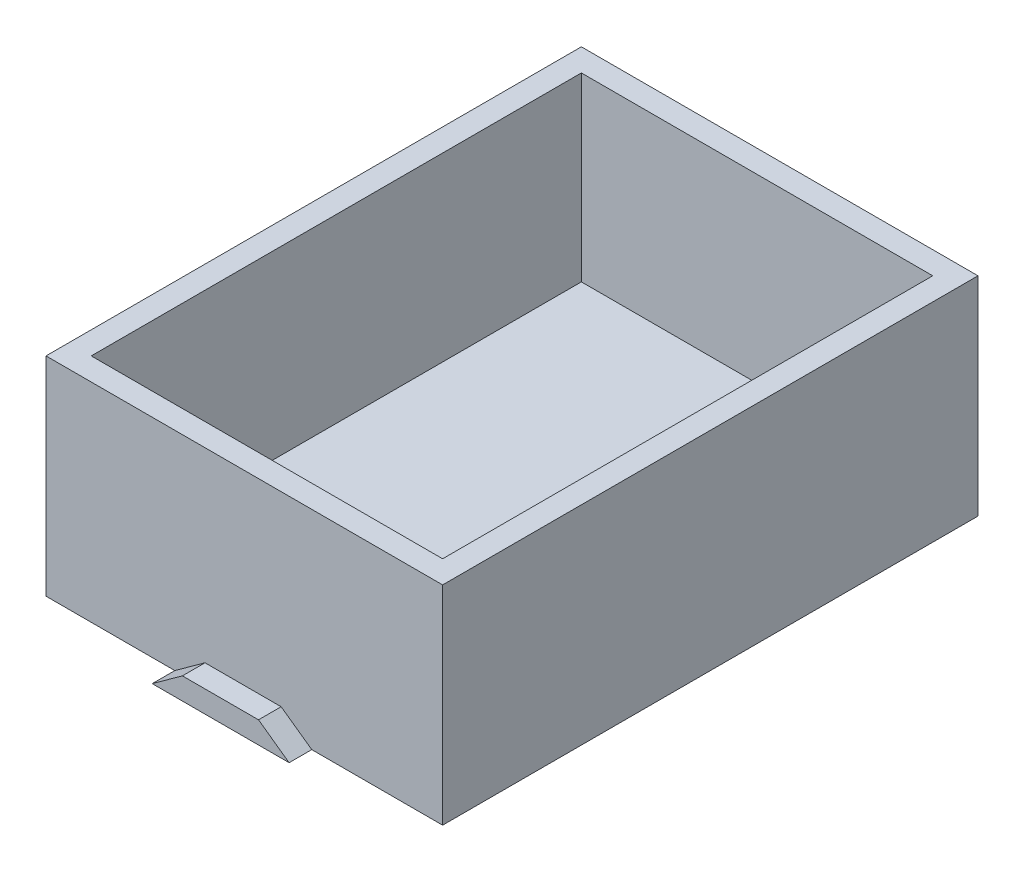
ISO-10303-21;
HEADER;
FILE_DESCRIPTION(('STEP AP214'),'2;1');
FILE_NAME('part.step','',(''),(''),'','','');
FILE_SCHEMA(('AUTOMOTIVE_DESIGN { 1 0 10303 214 1 1 1 1 }'));
ENDSEC;
DATA;
#1=APPLICATION_CONTEXT('core data for automotive mechanical design processes');
#2=APPLICATION_PROTOCOL_DEFINITION('international standard','automotive_design',2000,#1);
#3=PRODUCT_CONTEXT('',#1,'mechanical');
#4=PRODUCT('Part','Part','',(#3));
#5=PRODUCT_RELATED_PRODUCT_CATEGORY('part','',(#4));
#6=PRODUCT_DEFINITION_FORMATION('','',#4);
#7=PRODUCT_DEFINITION_CONTEXT('part definition',#1,'design');
#8=PRODUCT_DEFINITION('design','',#6,#7);
#9=PRODUCT_DEFINITION_SHAPE('','',#8);
#10=(LENGTH_UNIT() NAMED_UNIT(*) SI_UNIT(.MILLI.,.METRE.));
#11=(NAMED_UNIT(*) PLANE_ANGLE_UNIT() SI_UNIT($,.RADIAN.));
#12=(NAMED_UNIT(*) SI_UNIT($,.STERADIAN.) SOLID_ANGLE_UNIT());
#13=UNCERTAINTY_MEASURE_WITH_UNIT(LENGTH_MEASURE(1.E-05),#10,'distance_accuracy_value','');
#14=(GEOMETRIC_REPRESENTATION_CONTEXT(3) GLOBAL_UNCERTAINTY_ASSIGNED_CONTEXT((#13)) GLOBAL_UNIT_ASSIGNED_CONTEXT((#10,
#11,#12)) REPRESENTATION_CONTEXT('',''));
#15=CARTESIAN_POINT('',(0.,0.,0.));
#16=DIRECTION('',(0.,0.,1.));
#17=DIRECTION('',(1.,0.,0.));
#18=AXIS2_PLACEMENT_3D('',#15,#16,#17);
#19=CARTESIAN_POINT('',(0.,0.,0.));
#20=DIRECTION('',(0.,0.,-1.));
#21=DIRECTION('',(-1.,0.,0.));
#22=AXIS2_PLACEMENT_3D('',#19,#20,#21);
#23=PLANE('',#22);
#24=DIRECTION('',(-0.813991379659755,0.580876952408692,0.));
#25=VECTOR('',#24,1.);
#26=CARTESIAN_POINT('',(15.1022059545549,21.1629423578934,0.));
#27=LINE('',#26,#25);
#28=CARTESIAN_POINT('',(44.7581469866952,0.,0.));
#29=VERTEX_POINT('',#28);
#30=CARTESIAN_POINT('',(39.6021416062323,3.6794059087677,0.));
#31=VERTEX_POINT('',#30);
#32=EDGE_CURVE('E149',#29,#31,#27,.T.);
#33=ORIENTED_EDGE('',*,*,#32,.F.);
#34=DIRECTION('',(1.,0.,0.));
#35=VECTOR('',#34,1.);
#36=CARTESIAN_POINT('',(0.,0.,0.));
#37=LINE('',#36,#35);
#38=CARTESIAN_POINT('',(66.802,0.,0.));
#39=VERTEX_POINT('',#38);
#40=EDGE_CURVE('E222',#29,#39,#37,.T.);
#41=ORIENTED_EDGE('',*,*,#40,.T.);
#42=DIRECTION('',(0.,1.,0.));
#43=VECTOR('',#42,1.);
#44=CARTESIAN_POINT('',(66.802,35.052,0.));
#45=LINE('',#44,#43);
#46=CARTESIAN_POINT('',(66.802,35.052,0.));
#47=VERTEX_POINT('',#46);
#48=EDGE_CURVE('E226',#39,#47,#45,.T.);
#49=ORIENTED_EDGE('',*,*,#48,.T.);
#50=DIRECTION('',(-1.,0.,0.));
#51=VECTOR('',#50,1.);
#52=CARTESIAN_POINT('',(0.,35.052,0.));
#53=LINE('',#52,#51);
#54=CARTESIAN_POINT('',(0.,35.052,0.));
#55=VERTEX_POINT('',#54);
#56=EDGE_CURVE('E207',#47,#55,#53,.T.);
#57=ORIENTED_EDGE('',*,*,#56,.T.);
#58=DIRECTION('',(0.,-1.,0.));
#59=VECTOR('',#58,1.);
#60=CARTESIAN_POINT('',(0.,0.,0.));
#61=LINE('',#60,#59);
#62=CARTESIAN_POINT('',(0.,0.,0.));
#63=VERTEX_POINT('',#62);
#64=EDGE_CURVE('E192',#55,#63,#61,.T.);
#65=ORIENTED_EDGE('',*,*,#64,.T.);
#66=CARTESIAN_POINT('',(21.6954742713817,0.,0.));
#67=VERTEX_POINT('',#66);
#68=EDGE_CURVE('E223',#63,#67,#37,.T.);
#69=ORIENTED_EDGE('',*,*,#68,.T.);
#70=DIRECTION('',(-0.810229448212507,-0.586112822969483,0.));
#71=VECTOR('',#70,1.);
#72=CARTESIAN_POINT('',(7.45300811951626,-10.3028741558746,0.));
#73=LINE('',#72,#71);
#74=CARTESIAN_POINT('',(26.7818039034599,3.67940590876769,0.));
#75=VERTEX_POINT('',#74);
#76=EDGE_CURVE('E62',#75,#67,#73,.T.);
#77=ORIENTED_EDGE('',*,*,#76,.F.);
#78=DIRECTION('',(-1.,0.,0.));
#79=VECTOR('',#78,1.);
#80=CARTESIAN_POINT('',(0.,3.67940590876769,0.));
#81=LINE('',#80,#79);
#82=EDGE_CURVE('E57',#31,#75,#81,.T.);
#83=ORIENTED_EDGE('',*,*,#82,.F.);
#84=EDGE_LOOP('',(#33,#41,#49,#57,#65,#69,#77,#83));
#85=FACE_BOUND('',#84,.T.);
#86=ADVANCED_FACE('F39',(#85),#23,.F.);
#87=CARTESIAN_POINT('',(0.,0.,-90.17));
#88=DIRECTION('',(-1.,0.,0.));
#89=DIRECTION('',(0.,0.,1.));
#90=AXIS2_PLACEMENT_3D('',#87,#88,#89);
#91=PLANE('',#90);
#92=ORIENTED_EDGE('',*,*,#64,.F.);
#93=DIRECTION('',(0.,0.,1.));
#94=VECTOR('',#93,1.);
#95=CARTESIAN_POINT('',(0.,35.052,-90.17));
#96=LINE('',#95,#94);
#97=CARTESIAN_POINT('',(0.,35.052,-90.17));
#98=VERTEX_POINT('',#97);
#99=EDGE_CURVE('E11',#98,#55,#96,.T.);
#100=ORIENTED_EDGE('',*,*,#99,.F.);
#101=DIRECTION('',(0.,-1.,0.));
#102=VECTOR('',#101,1.);
#103=CARTESIAN_POINT('',(0.,0.,-90.17));
#104=LINE('',#103,#102);
#105=CARTESIAN_POINT('',(0.,0.,-90.17));
#106=VERTEX_POINT('',#105);
#107=EDGE_CURVE('E202',#98,#106,#104,.T.);
#108=ORIENTED_EDGE('',*,*,#107,.T.);
#109=DIRECTION('',(0.,0.,1.));
#110=VECTOR('',#109,1.);
#111=CARTESIAN_POINT('',(0.,0.,-90.17));
#112=LINE('',#111,#110);
#113=EDGE_CURVE('E43',#106,#63,#112,.T.);
#114=ORIENTED_EDGE('',*,*,#113,.T.);
#115=EDGE_LOOP('',(#92,#100,#108,#114));
#116=FACE_BOUND('',#115,.T.);
#117=ADVANCED_FACE('F41',(#116),#91,.T.);
#118=CARTESIAN_POINT('',(0.,35.052,-90.17));
#119=DIRECTION('',(0.,1.,0.));
#120=DIRECTION('',(0.,0.,1.));
#121=AXIS2_PLACEMENT_3D('',#118,#119,#120);
#122=PLANE('',#121);
#123=DIRECTION('',(1.,0.,0.));
#124=VECTOR('',#123,1.);
#125=CARTESIAN_POINT('',(3.81,35.052,-3.81));
#126=LINE('',#125,#124);
#127=CARTESIAN_POINT('',(3.81,35.052,-3.81));
#128=VERTEX_POINT('',#127);
#129=CARTESIAN_POINT('',(62.992,35.052,-3.80999999999999));
#130=VERTEX_POINT('',#129);
#131=EDGE_CURVE('E153',#128,#130,#126,.T.);
#132=ORIENTED_EDGE('',*,*,#131,.F.);
#133=DIRECTION('',(0.,0.,-1.));
#134=VECTOR('',#133,1.);
#135=CARTESIAN_POINT('',(3.81,35.052,-3.81));
#136=LINE('',#135,#134);
#137=CARTESIAN_POINT('',(3.81,35.052,-86.36));
#138=VERTEX_POINT('',#137);
#139=EDGE_CURVE('E168',#128,#138,#136,.T.);
#140=ORIENTED_EDGE('',*,*,#139,.T.);
#141=DIRECTION('',(1.,0.,0.));
#142=VECTOR('',#141,1.);
#143=CARTESIAN_POINT('',(3.81,35.052,-86.36));
#144=LINE('',#143,#142);
#145=CARTESIAN_POINT('',(62.992,35.052,-86.36));
#146=VERTEX_POINT('',#145);
#147=EDGE_CURVE('E182',#138,#146,#144,.T.);
#148=ORIENTED_EDGE('',*,*,#147,.T.);
#149=DIRECTION('',(0.,0.,-1.));
#150=VECTOR('',#149,1.);
#151=CARTESIAN_POINT('',(62.992,35.052,-3.81));
#152=LINE('',#151,#150);
#153=EDGE_CURVE('E157',#130,#146,#152,.T.);
#154=ORIENTED_EDGE('',*,*,#153,.F.);
#155=EDGE_LOOP('',(#132,#140,#148,#154));
#156=FACE_BOUND('',#155,.T.);
#157=ORIENTED_EDGE('',*,*,#56,.F.);
#158=DIRECTION('',(0.,0.,1.));
#159=VECTOR('',#158,1.);
#160=CARTESIAN_POINT('',(66.802,35.052,-90.17));
#161=LINE('',#160,#159);
#162=CARTESIAN_POINT('',(66.802,35.052,-90.17));
#163=VERTEX_POINT('',#162);
#164=EDGE_CURVE('E49',#163,#47,#161,.T.);
#165=ORIENTED_EDGE('',*,*,#164,.F.);
#166=DIRECTION('',(-1.,0.,0.));
#167=VECTOR('',#166,1.);
#168=CARTESIAN_POINT('',(0.,35.052,-90.17));
#169=LINE('',#168,#167);
#170=EDGE_CURVE('E215',#163,#98,#169,.T.);
#171=ORIENTED_EDGE('',*,*,#170,.T.);
#172=ORIENTED_EDGE('',*,*,#99,.T.);
#173=EDGE_LOOP('',(#157,#165,#171,#172));
#174=FACE_BOUND('',#173,.T.);
#175=ADVANCED_FACE('F249',(#156,#174),#122,.T.);
#176=CARTESIAN_POINT('',(66.802,35.052,-90.17));
#177=DIRECTION('',(1.,0.,0.));
#178=DIRECTION('',(0.,0.,-1.));
#179=AXIS2_PLACEMENT_3D('',#176,#177,#178);
#180=PLANE('',#179);
#181=ORIENTED_EDGE('',*,*,#48,.F.);
#182=DIRECTION('',(0.,0.,1.));
#183=VECTOR('',#182,1.);
#184=CARTESIAN_POINT('',(66.802,0.,-90.17));
#185=LINE('',#184,#183);
#186=CARTESIAN_POINT('',(66.802,0.,-90.17));
#187=VERTEX_POINT('',#186);
#188=EDGE_CURVE('E234',#187,#39,#185,.T.);
#189=ORIENTED_EDGE('',*,*,#188,.F.);
#190=DIRECTION('',(0.,1.,0.));
#191=VECTOR('',#190,1.);
#192=CARTESIAN_POINT('',(66.802,35.052,-90.17));
#193=LINE('',#192,#191);
#194=EDGE_CURVE('E211',#187,#163,#193,.T.);
#195=ORIENTED_EDGE('',*,*,#194,.T.);
#196=ORIENTED_EDGE('',*,*,#164,.T.);
#197=EDGE_LOOP('',(#181,#189,#195,#196));
#198=FACE_BOUND('',#197,.T.);
#199=ADVANCED_FACE('F255',(#198),#180,.T.);
#200=CARTESIAN_POINT('',(0.,0.,-90.17));
#201=DIRECTION('',(0.,-1.,0.));
#202=DIRECTION('',(0.,0.,-1.));
#203=AXIS2_PLACEMENT_3D('',#200,#201,#202);
#204=PLANE('',#203);
#205=ORIENTED_EDGE('',*,*,#68,.F.);
#206=ORIENTED_EDGE('',*,*,#113,.F.);
#207=DIRECTION('',(1.,0.,0.));
#208=VECTOR('',#207,1.);
#209=CARTESIAN_POINT('',(0.,0.,-90.17));
#210=LINE('',#209,#208);
#211=EDGE_CURVE('E206',#106,#187,#210,.T.);
#212=ORIENTED_EDGE('',*,*,#211,.T.);
#213=ORIENTED_EDGE('',*,*,#188,.T.);
#214=ORIENTED_EDGE('',*,*,#40,.F.);
#215=DIRECTION('',(0.,0.,-1.));
#216=VECTOR('',#215,1.);
#217=CARTESIAN_POINT('',(44.7581469866952,0.,3.81));
#218=LINE('',#217,#216);
#219=CARTESIAN_POINT('',(44.7581469866952,0.,3.81));
#220=VERTEX_POINT('',#219);
#221=EDGE_CURVE('E159',#220,#29,#218,.T.);
#222=ORIENTED_EDGE('',*,*,#221,.F.);
#223=DIRECTION('',(1.,0.,0.));
#224=VECTOR('',#223,1.);
#225=CARTESIAN_POINT('',(0.,0.,3.81));
#226=LINE('',#225,#224);
#227=CARTESIAN_POINT('',(21.6954742713817,0.,3.81));
#228=VERTEX_POINT('',#227);
#229=EDGE_CURVE('E138',#228,#220,#226,.T.);
#230=ORIENTED_EDGE('',*,*,#229,.F.);
#231=DIRECTION('',(0.,0.,-1.));
#232=VECTOR('',#231,1.);
#233=CARTESIAN_POINT('',(21.6954742713817,0.,3.81));
#234=LINE('',#233,#232);
#235=EDGE_CURVE('E134',#228,#67,#234,.T.);
#236=ORIENTED_EDGE('',*,*,#235,.T.);
#237=EDGE_LOOP('',(#205,#206,#212,#213,#214,#222,#230,#236));
#238=FACE_BOUND('',#237,.T.);
#239=ADVANCED_FACE('F246',(#238),#204,.T.);
#240=CARTESIAN_POINT('',(0.,0.,-90.17));
#241=DIRECTION('',(0.,0.,-1.));
#242=DIRECTION('',(-1.,0.,0.));
#243=AXIS2_PLACEMENT_3D('',#240,#241,#242);
#244=PLANE('',#243);
#245=ORIENTED_EDGE('',*,*,#107,.F.);
#246=ORIENTED_EDGE('',*,*,#170,.F.);
#247=ORIENTED_EDGE('',*,*,#194,.F.);
#248=ORIENTED_EDGE('',*,*,#211,.F.);
#249=EDGE_LOOP('',(#245,#246,#247,#248));
#250=FACE_BOUND('',#249,.T.);
#251=ADVANCED_FACE('F252',(#250),#244,.T.);
#252=CARTESIAN_POINT('',(3.81,4.572,-3.81));
#253=DIRECTION('',(0.,0.,1.));
#254=DIRECTION('',(1.,0.,0.));
#255=AXIS2_PLACEMENT_3D('',#252,#253,#254);
#256=PLANE('',#255);
#257=ORIENTED_EDGE('',*,*,#131,.T.);
#258=DIRECTION('',(0.,1.,0.));
#259=VECTOR('',#258,1.);
#260=CARTESIAN_POINT('',(62.992,4.572,-3.81));
#261=LINE('',#260,#259);
#262=CARTESIAN_POINT('',(62.992,4.572,-3.81));
#263=VERTEX_POINT('',#262);
#264=EDGE_CURVE('E177',#263,#130,#261,.T.);
#265=ORIENTED_EDGE('',*,*,#264,.F.);
#266=DIRECTION('',(1.,0.,0.));
#267=VECTOR('',#266,1.);
#268=CARTESIAN_POINT('',(3.81,4.572,-3.81));
#269=LINE('',#268,#267);
#270=CARTESIAN_POINT('',(3.81,4.572,-3.81));
#271=VERTEX_POINT('',#270);
#272=EDGE_CURVE('E163',#271,#263,#269,.T.);
#273=ORIENTED_EDGE('',*,*,#272,.F.);
#274=DIRECTION('',(0.,1.,0.));
#275=VECTOR('',#274,1.);
#276=CARTESIAN_POINT('',(3.81,4.572,-3.81));
#277=LINE('',#276,#275);
#278=EDGE_CURVE('E189',#271,#128,#277,.T.);
#279=ORIENTED_EDGE('',*,*,#278,.T.);
#280=EDGE_LOOP('',(#257,#265,#273,#279));
#281=FACE_BOUND('',#280,.T.);
#282=ADVANCED_FACE('F272',(#281),#256,.F.);
#283=CARTESIAN_POINT('',(3.81,4.572,-3.81));
#284=DIRECTION('',(1.,0.,0.));
#285=DIRECTION('',(0.,0.,-1.));
#286=AXIS2_PLACEMENT_3D('',#283,#284,#285);
#287=PLANE('',#286);
#288=ORIENTED_EDGE('',*,*,#139,.F.);
#289=ORIENTED_EDGE('',*,*,#278,.F.);
#290=DIRECTION('',(0.,0.,-1.));
#291=VECTOR('',#290,1.);
#292=CARTESIAN_POINT('',(3.81,4.572,-3.81));
#293=LINE('',#292,#291);
#294=CARTESIAN_POINT('',(3.81,4.572,-86.36));
#295=VERTEX_POINT('',#294);
#296=EDGE_CURVE('E175',#271,#295,#293,.T.);
#297=ORIENTED_EDGE('',*,*,#296,.T.);
#298=DIRECTION('',(0.,1.,0.));
#299=VECTOR('',#298,1.);
#300=CARTESIAN_POINT('',(3.81,4.572,-86.36));
#301=LINE('',#300,#299);
#302=EDGE_CURVE('E193',#295,#138,#301,.T.);
#303=ORIENTED_EDGE('',*,*,#302,.T.);
#304=EDGE_LOOP('',(#288,#289,#297,#303));
#305=FACE_BOUND('',#304,.T.);
#306=ADVANCED_FACE('F275',(#305),#287,.T.);
#307=CARTESIAN_POINT('',(3.81,4.572,-86.36));
#308=DIRECTION('',(0.,0.,1.));
#309=DIRECTION('',(1.,0.,0.));
#310=AXIS2_PLACEMENT_3D('',#307,#308,#309);
#311=PLANE('',#310);
#312=ORIENTED_EDGE('',*,*,#147,.F.);
#313=ORIENTED_EDGE('',*,*,#302,.F.);
#314=DIRECTION('',(1.,0.,0.));
#315=VECTOR('',#314,1.);
#316=CARTESIAN_POINT('',(3.81,4.572,-86.36));
#317=LINE('',#316,#315);
#318=CARTESIAN_POINT('',(62.992,4.572,-86.36));
#319=VERTEX_POINT('',#318);
#320=EDGE_CURVE('E172',#295,#319,#317,.T.);
#321=ORIENTED_EDGE('',*,*,#320,.T.);
#322=DIRECTION('',(0.,1.,0.));
#323=VECTOR('',#322,1.);
#324=CARTESIAN_POINT('',(62.992,4.572,-86.36));
#325=LINE('',#324,#323);
#326=EDGE_CURVE('E196',#319,#146,#325,.T.);
#327=ORIENTED_EDGE('',*,*,#326,.T.);
#328=EDGE_LOOP('',(#312,#313,#321,#327));
#329=FACE_BOUND('',#328,.T.);
#330=ADVANCED_FACE('F281',(#329),#311,.T.);
#331=CARTESIAN_POINT('',(62.992,4.572,-3.81));
#332=DIRECTION('',(1.,0.,0.));
#333=DIRECTION('',(0.,0.,-1.));
#334=AXIS2_PLACEMENT_3D('',#331,#332,#333);
#335=PLANE('',#334);
#336=ORIENTED_EDGE('',*,*,#153,.T.);
#337=ORIENTED_EDGE('',*,*,#326,.F.);
#338=DIRECTION('',(0.,0.,-1.));
#339=VECTOR('',#338,1.);
#340=CARTESIAN_POINT('',(62.992,4.572,-3.81));
#341=LINE('',#340,#339);
#342=EDGE_CURVE('E167',#263,#319,#341,.T.);
#343=ORIENTED_EDGE('',*,*,#342,.F.);
#344=ORIENTED_EDGE('',*,*,#264,.T.);
#345=EDGE_LOOP('',(#336,#337,#343,#344));
#346=FACE_BOUND('',#345,.T.);
#347=ADVANCED_FACE('F277',(#346),#335,.F.);
#348=CARTESIAN_POINT('',(0.,4.572,0.));
#349=DIRECTION('',(0.,1.,0.));
#350=DIRECTION('',(0.,0.,1.));
#351=AXIS2_PLACEMENT_3D('',#348,#349,#350);
#352=PLANE('',#351);
#353=ORIENTED_EDGE('',*,*,#272,.T.);
#354=ORIENTED_EDGE('',*,*,#342,.T.);
#355=ORIENTED_EDGE('',*,*,#320,.F.);
#356=ORIENTED_EDGE('',*,*,#296,.F.);
#357=EDGE_LOOP('',(#353,#354,#355,#356));
#358=FACE_BOUND('',#357,.T.);
#359=ADVANCED_FACE('F280',(#358),#352,.T.);
#360=CARTESIAN_POINT('',(0.,3.67940590876769,3.81));
#361=DIRECTION('',(0.,-1.,0.));
#362=DIRECTION('',(0.,0.,-1.));
#363=AXIS2_PLACEMENT_3D('',#360,#361,#362);
#364=PLANE('',#363);
#365=ORIENTED_EDGE('',*,*,#82,.T.);
#366=DIRECTION('',(0.,0.,-1.));
#367=VECTOR('',#366,1.);
#368=CARTESIAN_POINT('',(26.7818039034599,3.67940590876769,3.81));
#369=LINE('',#368,#367);
#370=CARTESIAN_POINT('',(26.7818039034599,3.67940590876769,3.81));
#371=VERTEX_POINT('',#370);
#372=EDGE_CURVE('E132',#371,#75,#369,.T.);
#373=ORIENTED_EDGE('',*,*,#372,.F.);
#374=DIRECTION('',(-1.,0.,0.));
#375=VECTOR('',#374,1.);
#376=CARTESIAN_POINT('',(0.,3.67940590876769,3.81));
#377=LINE('',#376,#375);
#378=CARTESIAN_POINT('',(39.6021416062323,3.6794059087677,3.81));
#379=VERTEX_POINT('',#378);
#380=EDGE_CURVE('E139',#379,#371,#377,.T.);
#381=ORIENTED_EDGE('',*,*,#380,.F.);
#382=DIRECTION('',(0.,0.,-1.));
#383=VECTOR('',#382,1.);
#384=CARTESIAN_POINT('',(39.6021416062323,3.6794059087677,3.81));
#385=LINE('',#384,#383);
#386=EDGE_CURVE('E400',#379,#31,#385,.T.);
#387=ORIENTED_EDGE('',*,*,#386,.T.);
#388=EDGE_LOOP('',(#365,#373,#381,#387));
#389=FACE_BOUND('',#388,.T.);
#390=ADVANCED_FACE('F151',(#389),#364,.F.);
#391=CARTESIAN_POINT('',(7.45300811951626,-10.3028741558746,3.81));
#392=DIRECTION('',(0.586112822969483,-0.810229448212507,0.));
#393=DIRECTION('',(0.810229448212507,0.586112822969483,0.));
#394=AXIS2_PLACEMENT_3D('',#391,#392,#393);
#395=PLANE('',#394);
#396=ORIENTED_EDGE('',*,*,#76,.T.);
#397=ORIENTED_EDGE('',*,*,#235,.F.);
#398=DIRECTION('',(-0.810229448212507,-0.586112822969483,0.));
#399=VECTOR('',#398,1.);
#400=CARTESIAN_POINT('',(7.45300811951626,-10.3028741558746,3.81));
#401=LINE('',#400,#399);
#402=EDGE_CURVE('E128',#371,#228,#401,.T.);
#403=ORIENTED_EDGE('',*,*,#402,.F.);
#404=ORIENTED_EDGE('',*,*,#372,.T.);
#405=EDGE_LOOP('',(#396,#397,#403,#404));
#406=FACE_BOUND('',#405,.T.);
#407=ADVANCED_FACE('F130',(#406),#395,.F.);
#408=CARTESIAN_POINT('',(15.1022059545549,21.1629423578934,3.81));
#409=DIRECTION('',(-0.580876952408692,-0.813991379659754,0.));
#410=DIRECTION('',(0.813991379659755,-0.580876952408692,0.));
#411=AXIS2_PLACEMENT_3D('',#408,#409,#410);
#412=PLANE('',#411);
#413=ORIENTED_EDGE('',*,*,#32,.T.);
#414=ORIENTED_EDGE('',*,*,#386,.F.);
#415=DIRECTION('',(-0.813991379659755,0.580876952408692,0.));
#416=VECTOR('',#415,1.);
#417=CARTESIAN_POINT('',(15.1022059545549,21.1629423578934,3.81));
#418=LINE('',#417,#416);
#419=EDGE_CURVE('E144',#220,#379,#418,.T.);
#420=ORIENTED_EDGE('',*,*,#419,.F.);
#421=ORIENTED_EDGE('',*,*,#221,.T.);
#422=EDGE_LOOP('',(#413,#414,#420,#421));
#423=FACE_BOUND('',#422,.T.);
#424=ADVANCED_FACE('F296',(#423),#412,.F.);
#425=CARTESIAN_POINT('',(0.,0.,3.81));
#426=DIRECTION('',(0.,0.,1.));
#427=DIRECTION('',(1.,0.,0.));
#428=AXIS2_PLACEMENT_3D('',#425,#426,#427);
#429=PLANE('',#428);
#430=ORIENTED_EDGE('',*,*,#380,.T.);
#431=ORIENTED_EDGE('',*,*,#402,.T.);
#432=ORIENTED_EDGE('',*,*,#229,.T.);
#433=ORIENTED_EDGE('',*,*,#419,.T.);
#434=EDGE_LOOP('',(#430,#431,#432,#433));
#435=FACE_BOUND('',#434,.T.);
#436=ADVANCED_FACE('F142',(#435),#429,.T.);
#437=CLOSED_SHELL('',(#86,#117,#175,#199,#239,#251,#282,#306,#330,#347,#359,#390,#407,#424,#436));
#438=MANIFOLD_SOLID_BREP('B2',#437);
#439=ADVANCED_BREP_SHAPE_REPRESENTATION('',(#18,#438),#14);
#440=SHAPE_DEFINITION_REPRESENTATION(#9,#439);
ENDSEC;
END-ISO-10303-21;
